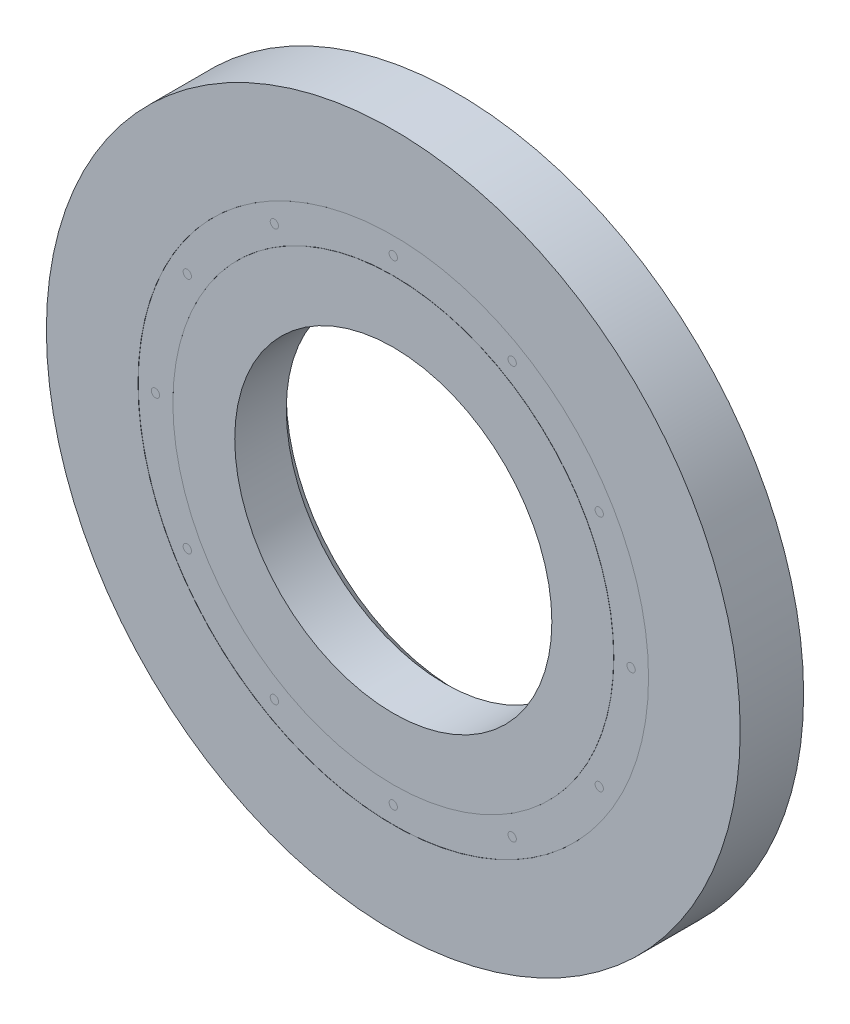
ISO-10303-21;
HEADER;
FILE_DESCRIPTION(('STEP AP214'),'2;1');
FILE_NAME('part.step','',(''),(''),'','','');
FILE_SCHEMA(('AUTOMOTIVE_DESIGN { 1 0 10303 214 1 1 1 1 }'));
ENDSEC;
DATA;
#1=APPLICATION_CONTEXT('core data for automotive mechanical design processes');
#2=APPLICATION_PROTOCOL_DEFINITION('international standard','automotive_design',2000,#1);
#3=PRODUCT_CONTEXT('',#1,'mechanical');
#4=PRODUCT('Part','Part','',(#3));
#5=PRODUCT_RELATED_PRODUCT_CATEGORY('part','',(#4));
#6=PRODUCT_DEFINITION_FORMATION('','',#4);
#7=PRODUCT_DEFINITION_CONTEXT('part definition',#1,'design');
#8=PRODUCT_DEFINITION('design','',#6,#7);
#9=PRODUCT_DEFINITION_SHAPE('','',#8);
#10=(LENGTH_UNIT() NAMED_UNIT(*) SI_UNIT(.MILLI.,.METRE.));
#11=(NAMED_UNIT(*) PLANE_ANGLE_UNIT() SI_UNIT($,.RADIAN.));
#12=(NAMED_UNIT(*) SI_UNIT($,.STERADIAN.) SOLID_ANGLE_UNIT());
#13=UNCERTAINTY_MEASURE_WITH_UNIT(LENGTH_MEASURE(1.E-05),#10,'distance_accuracy_value','');
#14=(GEOMETRIC_REPRESENTATION_CONTEXT(3) GLOBAL_UNCERTAINTY_ASSIGNED_CONTEXT((#13)) GLOBAL_UNIT_ASSIGNED_CONTEXT((#10,
#11,#12)) REPRESENTATION_CONTEXT('',''));
#15=CARTESIAN_POINT('',(0.,0.,0.));
#16=DIRECTION('',(0.,0.,1.));
#17=DIRECTION('',(1.,0.,0.));
#18=AXIS2_PLACEMENT_3D('',#15,#16,#17);
#19=CARTESIAN_POINT('',(0.,5.1114010989011,-2.2621875));
#20=DIRECTION('',(0.,0.,1.));
#21=DIRECTION('',(1.,0.,0.));
#22=AXIS2_PLACEMENT_3D('',#19,#20,#21);
#23=PLANE('',#22);
#24=CARTESIAN_POINT('',(0.,0.,-2.2621875));
#25=DIRECTION('',(0.,0.,1.));
#26=DIRECTION('',(1.,0.,0.));
#27=AXIS2_PLACEMENT_3D('',#24,#25,#26);
#28=CIRCLE('',#27,5.1114010989011);
#29=CARTESIAN_POINT('',(5.1114010989011,0.,-2.2621875));
#30=VERTEX_POINT('',#29);
#31=EDGE_CURVE('E57',#30,#30,#28,.T.);
#32=ORIENTED_EDGE('',*,*,#31,.F.);
#33=EDGE_LOOP('',(#32));
#34=FACE_BOUND('',#33,.T.);
#35=CARTESIAN_POINT('',(0.,0.,-2.2621875));
#36=DIRECTION('',(0.,0.,1.));
#37=DIRECTION('',(1.,0.,0.));
#38=AXIS2_PLACEMENT_3D('',#35,#36,#37);
#39=CIRCLE('',#38,4.4135989010989);
#40=CARTESIAN_POINT('',(4.4135989010989,0.,-2.2621875));
#41=VERTEX_POINT('',#40);
#42=EDGE_CURVE('E11',#41,#41,#39,.T.);
#43=ORIENTED_EDGE('',*,*,#42,.T.);
#44=EDGE_LOOP('',(#43));
#45=FACE_BOUND('',#44,.T.);
#46=ADVANCED_FACE('F43',(#34,#45),#23,.F.);
#47=CARTESIAN_POINT('',(0.,0.,2.38125));
#48=DIRECTION('',(0.,0.,1.));
#49=DIRECTION('',(1.,0.,0.));
#50=AXIS2_PLACEMENT_3D('',#47,#48,#49);
#51=CYLINDRICAL_SURFACE('',#50,4.4135989010989);
#52=ORIENTED_EDGE('',*,*,#42,.F.);
#53=EDGE_LOOP('',(#52));
#54=FACE_BOUND('',#53,.T.);
#55=CARTESIAN_POINT('',(0.,0.,-1.11436144103197));
#56=DIRECTION('',(0.,0.,1.));
#57=DIRECTION('',(1.,0.,0.));
#58=AXIS2_PLACEMENT_3D('',#55,#56,#57);
#59=CIRCLE('',#58,4.4135989010989);
#60=CARTESIAN_POINT('',(4.4135989010989,0.,-1.11436144103197));
#61=VERTEX_POINT('',#60);
#62=EDGE_CURVE('E49',#61,#61,#59,.T.);
#63=ORIENTED_EDGE('',*,*,#62,.T.);
#64=EDGE_LOOP('',(#63));
#65=FACE_BOUND('',#64,.T.);
#66=ADVANCED_FACE('F66',(#54,#65),#51,.F.);
#67=CARTESIAN_POINT('',(0.,5.1114010989011,-1.11436144103197));
#68=DIRECTION('',(0.,0.,-1.));
#69=DIRECTION('',(-1.,0.,0.));
#70=AXIS2_PLACEMENT_3D('',#67,#68,#69);
#71=PLANE('',#70);
#72=ORIENTED_EDGE('',*,*,#62,.F.);
#73=EDGE_LOOP('',(#72));
#74=FACE_BOUND('',#73,.T.);
#75=CARTESIAN_POINT('',(0.,0.,-1.11436144103197));
#76=DIRECTION('',(0.,0.,1.));
#77=DIRECTION('',(1.,0.,0.));
#78=AXIS2_PLACEMENT_3D('',#75,#76,#77);
#79=CIRCLE('',#78,5.1114010989011);
#80=CARTESIAN_POINT('',(5.1114010989011,0.,-1.11436144103197));
#81=VERTEX_POINT('',#80);
#82=EDGE_CURVE('E53',#81,#81,#79,.T.);
#83=ORIENTED_EDGE('',*,*,#82,.T.);
#84=EDGE_LOOP('',(#83));
#85=FACE_BOUND('',#84,.T.);
#86=ADVANCED_FACE('F70',(#74,#85),#71,.F.);
#87=CARTESIAN_POINT('',(0.,0.,2.38125));
#88=DIRECTION('',(0.,0.,1.));
#89=DIRECTION('',(1.,0.,0.));
#90=AXIS2_PLACEMENT_3D('',#87,#88,#89);
#91=CYLINDRICAL_SURFACE('',#90,5.1114010989011);
#92=ORIENTED_EDGE('',*,*,#82,.F.);
#93=EDGE_LOOP('',(#92));
#94=FACE_BOUND('',#93,.T.);
#95=ORIENTED_EDGE('',*,*,#31,.T.);
#96=EDGE_LOOP('',(#95));
#97=FACE_BOUND('',#96,.T.);
#98=ADVANCED_FACE('F63',(#94,#97),#91,.T.);
#99=CLOSED_SHELL('',(#46,#66,#86,#98));
#100=MANIFOLD_SOLID_BREP('B2',#99);
#101=CARTESIAN_POINT('',(-2.38124999999995,4.12444598552342,0.));
#102=DIRECTION('',(0.,0.,1.));
#103=DIRECTION('',(-0.499999999999989,0.866025403784445,0.));
#104=AXIS2_PLACEMENT_3D('',#101,#102,#103);
#105=SPHERICAL_SURFACE('',#104,1.11436144103197);
#106=CARTESIAN_POINT('',(-2.38124999999995,4.12444598552342,-1.11124999999997));
#107=DIRECTION('',(0.,0.,-1.));
#108=DIRECTION('',(-1.,0.,0.));
#109=AXIS2_PLACEMENT_3D('',#106,#107,#108);
#110=CIRCLE('',#109,0.0832157362456983);
#111=CARTESIAN_POINT('',(-2.46446573624565,4.12444598552342,-1.11124999999997));
#112=VERTEX_POINT('',#111);
#113=EDGE_CURVE('E42',#112,#112,#110,.T.);
#114=ORIENTED_EDGE('',*,*,#113,.T.);
#115=EDGE_LOOP('',(#114));
#116=FACE_BOUND('',#115,.T.);
#117=ADVANCED_FACE('F112',(#116),#105,.T.);
#118=CARTESIAN_POINT('',(0.,0.,-1.11124999999997));
#119=DIRECTION('',(0.,0.,-1.));
#120=DIRECTION('',(-1.,0.,0.));
#121=AXIS2_PLACEMENT_3D('',#118,#119,#120);
#122=PLANE('',#121);
#123=ORIENTED_EDGE('',*,*,#113,.F.);
#124=EDGE_LOOP('',(#123));
#125=FACE_BOUND('',#124,.T.);
#126=ADVANCED_FACE('F120',(#125),#122,.F.);
#127=CLOSED_SHELL('',(#117,#126));
#128=MANIFOLD_SOLID_BREP('B6',#127);
#129=CARTESIAN_POINT('',(-4.12444598552336,2.38125000000005,0.));
#130=DIRECTION('',(0.,0.,1.));
#131=DIRECTION('',(-0.866025403784433,0.50000000000001,0.));
#132=AXIS2_PLACEMENT_3D('',#129,#130,#131);
#133=SPHERICAL_SURFACE('',#132,1.11436144103197);
#134=CARTESIAN_POINT('',(-4.12444598552336,2.38125000000005,-1.11124999999997));
#135=DIRECTION('',(0.,0.,-1.));
#136=DIRECTION('',(-1.,0.,0.));
#137=AXIS2_PLACEMENT_3D('',#134,#135,#136);
#138=CIRCLE('',#137,0.0832157362457047);
#139=CARTESIAN_POINT('',(-4.20766172176906,2.38125000000005,-1.11124999999997));
#140=VERTEX_POINT('',#139);
#141=EDGE_CURVE('E111',#140,#140,#138,.T.);
#142=ORIENTED_EDGE('',*,*,#141,.T.);
#143=EDGE_LOOP('',(#142));
#144=FACE_BOUND('',#143,.T.);
#145=ADVANCED_FACE('F147',(#144),#133,.T.);
#146=CARTESIAN_POINT('',(0.,0.,-1.11124999999997));
#147=DIRECTION('',(0.,0.,-1.));
#148=DIRECTION('',(-1.,0.,0.));
#149=AXIS2_PLACEMENT_3D('',#146,#147,#148);
#150=PLANE('',#149);
#151=ORIENTED_EDGE('',*,*,#141,.F.);
#152=EDGE_LOOP('',(#151));
#153=FACE_BOUND('',#152,.T.);
#154=ADVANCED_FACE('F155',(#153),#150,.F.);
#155=CLOSED_SHELL('',(#145,#154));
#156=MANIFOLD_SOLID_BREP('B37',#155);
#157=CARTESIAN_POINT('',(-4.7625,0.,0.));
#158=DIRECTION('',(0.,0.,1.));
#159=DIRECTION('',(-1.,0.,0.));
#160=AXIS2_PLACEMENT_3D('',#157,#158,#159);
#161=SPHERICAL_SURFACE('',#160,1.11436144103197);
#162=CARTESIAN_POINT('',(-4.7625,0.,-1.11124999999997));
#163=DIRECTION('',(0.,0.,-1.));
#164=DIRECTION('',(-1.,0.,0.));
#165=AXIS2_PLACEMENT_3D('',#162,#163,#164);
#166=CIRCLE('',#165,0.0832157362457047);
#167=CARTESIAN_POINT('',(-4.8457157362457,0.,-1.11124999999997));
#168=VERTEX_POINT('',#167);
#169=EDGE_CURVE('E146',#168,#168,#166,.T.);
#170=ORIENTED_EDGE('',*,*,#169,.T.);
#171=EDGE_LOOP('',(#170));
#172=FACE_BOUND('',#171,.T.);
#173=ADVANCED_FACE('F182',(#172),#161,.T.);
#174=CARTESIAN_POINT('',(0.,0.,-1.11124999999997));
#175=DIRECTION('',(0.,0.,-1.));
#176=DIRECTION('',(-1.,0.,0.));
#177=AXIS2_PLACEMENT_3D('',#174,#175,#176);
#178=PLANE('',#177);
#179=ORIENTED_EDGE('',*,*,#169,.F.);
#180=EDGE_LOOP('',(#179));
#181=FACE_BOUND('',#180,.T.);
#182=ADVANCED_FACE('F190',(#181),#178,.F.);
#183=CLOSED_SHELL('',(#173,#182));
#184=MANIFOLD_SOLID_BREP('B106',#183);
#185=CARTESIAN_POINT('',(-4.12444598552341,-2.38124999999996,0.));
#186=DIRECTION('',(0.,0.,1.));
#187=DIRECTION('',(-0.866025403784443,-0.499999999999992,0.));
#188=AXIS2_PLACEMENT_3D('',#185,#186,#187);
#189=SPHERICAL_SURFACE('',#188,1.11436144103197);
#190=CARTESIAN_POINT('',(-4.12444598552341,-2.38124999999996,-1.11124999999997));
#191=DIRECTION('',(0.,0.,-1.));
#192=DIRECTION('',(-1.,0.,0.));
#193=AXIS2_PLACEMENT_3D('',#190,#191,#192);
#194=CIRCLE('',#193,0.0832157362457021);
#195=CARTESIAN_POINT('',(-4.20766172176911,-2.38124999999996,-1.11124999999997));
#196=VERTEX_POINT('',#195);
#197=EDGE_CURVE('E181',#196,#196,#194,.T.);
#198=ORIENTED_EDGE('',*,*,#197,.T.);
#199=EDGE_LOOP('',(#198));
#200=FACE_BOUND('',#199,.T.);
#201=ADVANCED_FACE('F217',(#200),#189,.T.);
#202=CARTESIAN_POINT('',(0.,0.,-1.11124999999997));
#203=DIRECTION('',(0.,0.,-1.));
#204=DIRECTION('',(-1.,0.,0.));
#205=AXIS2_PLACEMENT_3D('',#202,#203,#204);
#206=PLANE('',#205);
#207=ORIENTED_EDGE('',*,*,#197,.F.);
#208=EDGE_LOOP('',(#207));
#209=FACE_BOUND('',#208,.T.);
#210=ADVANCED_FACE('F225',(#209),#206,.F.);
#211=CLOSED_SHELL('',(#201,#210));
#212=MANIFOLD_SOLID_BREP('B141',#211);
#213=CARTESIAN_POINT('',(-2.38125000000003,-4.12444598552337,0.));
#214=DIRECTION('',(0.,0.,1.));
#215=DIRECTION('',(-0.500000000000007,-0.866025403784435,0.));
#216=AXIS2_PLACEMENT_3D('',#213,#214,#215);
#217=SPHERICAL_SURFACE('',#216,1.11436144103197);
#218=CARTESIAN_POINT('',(-2.38125000000003,-4.12444598552337,-1.11124999999997));
#219=DIRECTION('',(0.,0.,-1.));
#220=DIRECTION('',(-1.,0.,0.));
#221=AXIS2_PLACEMENT_3D('',#218,#219,#220);
#222=CIRCLE('',#221,0.0832157362456983);
#223=CARTESIAN_POINT('',(-2.46446573624573,-4.12444598552337,-1.11124999999997));
#224=VERTEX_POINT('',#223);
#225=EDGE_CURVE('E216',#224,#224,#222,.T.);
#226=ORIENTED_EDGE('',*,*,#225,.T.);
#227=EDGE_LOOP('',(#226));
#228=FACE_BOUND('',#227,.T.);
#229=ADVANCED_FACE('F252',(#228),#217,.T.);
#230=CARTESIAN_POINT('',(0.,0.,-1.11124999999997));
#231=DIRECTION('',(0.,0.,-1.));
#232=DIRECTION('',(-1.,0.,0.));
#233=AXIS2_PLACEMENT_3D('',#230,#231,#232);
#234=PLANE('',#233);
#235=ORIENTED_EDGE('',*,*,#225,.F.);
#236=EDGE_LOOP('',(#235));
#237=FACE_BOUND('',#236,.T.);
#238=ADVANCED_FACE('F260',(#237),#234,.F.);
#239=CLOSED_SHELL('',(#229,#238));
#240=MANIFOLD_SOLID_BREP('B176',#239);
#241=CARTESIAN_POINT('',(0.,-4.7625,0.));
#242=DIRECTION('',(0.,0.,1.));
#243=DIRECTION('',(0.,-1.,0.));
#244=AXIS2_PLACEMENT_3D('',#241,#242,#243);
#245=SPHERICAL_SURFACE('',#244,1.11436144103197);
#246=CARTESIAN_POINT('',(0.,-4.7625,-1.11124999999997));
#247=DIRECTION('',(0.,0.,-1.));
#248=DIRECTION('',(-1.,0.,0.));
#249=AXIS2_PLACEMENT_3D('',#246,#247,#248);
#250=CIRCLE('',#249,0.0832157362456907);
#251=CARTESIAN_POINT('',(-0.0832157362457242,-4.7625,-1.11124999999997));
#252=VERTEX_POINT('',#251);
#253=EDGE_CURVE('E251',#252,#252,#250,.T.);
#254=ORIENTED_EDGE('',*,*,#253,.T.);
#255=EDGE_LOOP('',(#254));
#256=FACE_BOUND('',#255,.T.);
#257=ADVANCED_FACE('F287',(#256),#245,.T.);
#258=CARTESIAN_POINT('',(0.,0.,-1.11124999999997));
#259=DIRECTION('',(0.,0.,-1.));
#260=DIRECTION('',(-1.,0.,0.));
#261=AXIS2_PLACEMENT_3D('',#258,#259,#260);
#262=PLANE('',#261);
#263=ORIENTED_EDGE('',*,*,#253,.F.);
#264=EDGE_LOOP('',(#263));
#265=FACE_BOUND('',#264,.T.);
#266=ADVANCED_FACE('F295',(#265),#262,.F.);
#267=CLOSED_SHELL('',(#257,#266));
#268=MANIFOLD_SOLID_BREP('B211',#267);
#269=CARTESIAN_POINT('',(2.38124999999998,-4.1244459855234,0.));
#270=DIRECTION('',(0.,0.,1.));
#271=DIRECTION('',(0.499999999999995,-0.866025403784442,0.));
#272=AXIS2_PLACEMENT_3D('',#269,#270,#271);
#273=SPHERICAL_SURFACE('',#272,1.11436144103197);
#274=CARTESIAN_POINT('',(2.38124999999998,-4.1244459855234,-1.11124999999997));
#275=DIRECTION('',(0.,0.,-1.));
#276=DIRECTION('',(-1.,0.,0.));
#277=AXIS2_PLACEMENT_3D('',#274,#275,#276);
#278=CIRCLE('',#277,0.0832157362456818);
#279=CARTESIAN_POINT('',(2.29803426375429,-4.1244459855234,-1.11124999999997));
#280=VERTEX_POINT('',#279);
#281=EDGE_CURVE('E286',#280,#280,#278,.T.);
#282=ORIENTED_EDGE('',*,*,#281,.T.);
#283=EDGE_LOOP('',(#282));
#284=FACE_BOUND('',#283,.T.);
#285=ADVANCED_FACE('F322',(#284),#273,.T.);
#286=CARTESIAN_POINT('',(0.,0.,-1.11124999999997));
#287=DIRECTION('',(0.,0.,-1.));
#288=DIRECTION('',(-1.,0.,0.));
#289=AXIS2_PLACEMENT_3D('',#286,#287,#288);
#290=PLANE('',#289);
#291=ORIENTED_EDGE('',*,*,#281,.F.);
#292=EDGE_LOOP('',(#291));
#293=FACE_BOUND('',#292,.T.);
#294=ADVANCED_FACE('F330',(#293),#290,.F.);
#295=CLOSED_SHELL('',(#285,#294));
#296=MANIFOLD_SOLID_BREP('B246',#295);
#297=CARTESIAN_POINT('',(4.12444598552338,-2.38125000000002,0.));
#298=DIRECTION('',(0.,0.,1.));
#299=DIRECTION('',(0.866025403784436,-0.500000000000004,0.));
#300=AXIS2_PLACEMENT_3D('',#297,#298,#299);
#301=SPHERICAL_SURFACE('',#300,1.11436144103197);
#302=CARTESIAN_POINT('',(4.12444598552338,-2.38125000000002,-1.11124999999997));
#303=DIRECTION('',(0.,0.,-1.));
#304=DIRECTION('',(-1.,0.,0.));
#305=AXIS2_PLACEMENT_3D('',#302,#303,#304);
#306=CIRCLE('',#305,0.0832157362456754);
#307=CARTESIAN_POINT('',(4.0412302492777,-2.38125000000002,-1.11124999999997));
#308=VERTEX_POINT('',#307);
#309=EDGE_CURVE('E321',#308,#308,#306,.T.);
#310=ORIENTED_EDGE('',*,*,#309,.T.);
#311=EDGE_LOOP('',(#310));
#312=FACE_BOUND('',#311,.T.);
#313=ADVANCED_FACE('F357',(#312),#301,.T.);
#314=CARTESIAN_POINT('',(0.,0.,-1.11124999999997));
#315=DIRECTION('',(0.,0.,-1.));
#316=DIRECTION('',(-1.,0.,0.));
#317=AXIS2_PLACEMENT_3D('',#314,#315,#316);
#318=PLANE('',#317);
#319=ORIENTED_EDGE('',*,*,#309,.F.);
#320=EDGE_LOOP('',(#319));
#321=FACE_BOUND('',#320,.T.);
#322=ADVANCED_FACE('F365',(#321),#318,.F.);
#323=CLOSED_SHELL('',(#313,#322));
#324=MANIFOLD_SOLID_BREP('B281',#323);
#325=CARTESIAN_POINT('',(4.7625,0.,0.));
#326=DIRECTION('',(0.,0.,1.));
#327=DIRECTION('',(1.,0.,0.));
#328=AXIS2_PLACEMENT_3D('',#325,#326,#327);
#329=SPHERICAL_SURFACE('',#328,1.11436144103197);
#330=CARTESIAN_POINT('',(4.7625,0.,-1.11124999999997));
#331=DIRECTION('',(0.,0.,-1.));
#332=DIRECTION('',(-1.,0.,0.));
#333=AXIS2_PLACEMENT_3D('',#330,#331,#332);
#334=CIRCLE('',#333,0.0832157362456754);
#335=CARTESIAN_POINT('',(4.67928426375432,0.,-1.11124999999997));
#336=VERTEX_POINT('',#335);
#337=EDGE_CURVE('E356',#336,#336,#334,.T.);
#338=ORIENTED_EDGE('',*,*,#337,.T.);
#339=EDGE_LOOP('',(#338));
#340=FACE_BOUND('',#339,.T.);
#341=ADVANCED_FACE('F392',(#340),#329,.T.);
#342=CARTESIAN_POINT('',(0.,0.,-1.11124999999997));
#343=DIRECTION('',(0.,0.,-1.));
#344=DIRECTION('',(-1.,0.,0.));
#345=AXIS2_PLACEMENT_3D('',#342,#343,#344);
#346=PLANE('',#345);
#347=ORIENTED_EDGE('',*,*,#337,.F.);
#348=EDGE_LOOP('',(#347));
#349=FACE_BOUND('',#348,.T.);
#350=ADVANCED_FACE('F400',(#349),#346,.F.);
#351=CLOSED_SHELL('',(#341,#350));
#352=MANIFOLD_SOLID_BREP('B316',#351);
#353=CARTESIAN_POINT('',(4.12444598552339,2.38124999999999,0.));
#354=DIRECTION('',(0.,0.,1.));
#355=DIRECTION('',(0.86602540378444,0.499999999999998,0.));
#356=AXIS2_PLACEMENT_3D('',#353,#354,#355);
#357=SPHERICAL_SURFACE('',#356,1.11436144103197);
#358=CARTESIAN_POINT('',(4.12444598552339,2.38124999999999,-1.11124999999997));
#359=DIRECTION('',(0.,0.,-1.));
#360=DIRECTION('',(-1.,0.,0.));
#361=AXIS2_PLACEMENT_3D('',#358,#359,#360);
#362=CIRCLE('',#361,0.0832157362456779);
#363=CARTESIAN_POINT('',(4.04123024927772,2.38124999999999,-1.11124999999997));
#364=VERTEX_POINT('',#363);
#365=EDGE_CURVE('E391',#364,#364,#362,.T.);
#366=ORIENTED_EDGE('',*,*,#365,.T.);
#367=EDGE_LOOP('',(#366));
#368=FACE_BOUND('',#367,.T.);
#369=ADVANCED_FACE('F427',(#368),#357,.T.);
#370=CARTESIAN_POINT('',(0.,0.,-1.11124999999997));
#371=DIRECTION('',(0.,0.,-1.));
#372=DIRECTION('',(-1.,0.,0.));
#373=AXIS2_PLACEMENT_3D('',#370,#371,#372);
#374=PLANE('',#373);
#375=ORIENTED_EDGE('',*,*,#365,.F.);
#376=EDGE_LOOP('',(#375));
#377=FACE_BOUND('',#376,.T.);
#378=ADVANCED_FACE('F435',(#377),#374,.F.);
#379=CLOSED_SHELL('',(#369,#378));
#380=MANIFOLD_SOLID_BREP('B351',#379);
#381=CARTESIAN_POINT('',(2.38125,4.12444598552339,0.));
#382=DIRECTION('',(0.,0.,1.));
#383=DIRECTION('',(0.500000000000001,0.866025403784438,0.));
#384=AXIS2_PLACEMENT_3D('',#381,#382,#383);
#385=SPHERICAL_SURFACE('',#384,1.11436144103197);
#386=CARTESIAN_POINT('',(2.38125,4.12444598552339,-1.11124999999997));
#387=DIRECTION('',(0.,0.,-1.));
#388=DIRECTION('',(-1.,0.,0.));
#389=AXIS2_PLACEMENT_3D('',#386,#387,#388);
#390=CIRCLE('',#389,0.0832157362456818);
#391=CARTESIAN_POINT('',(2.29803426375432,4.12444598552339,-1.11124999999997));
#392=VERTEX_POINT('',#391);
#393=EDGE_CURVE('E426',#392,#392,#390,.T.);
#394=ORIENTED_EDGE('',*,*,#393,.T.);
#395=EDGE_LOOP('',(#394));
#396=FACE_BOUND('',#395,.T.);
#397=ADVANCED_FACE('F462',(#396),#385,.T.);
#398=CARTESIAN_POINT('',(0.,0.,-1.11124999999997));
#399=DIRECTION('',(0.,0.,-1.));
#400=DIRECTION('',(-1.,0.,0.));
#401=AXIS2_PLACEMENT_3D('',#398,#399,#400);
#402=PLANE('',#401);
#403=ORIENTED_EDGE('',*,*,#393,.F.);
#404=EDGE_LOOP('',(#403));
#405=FACE_BOUND('',#404,.T.);
#406=ADVANCED_FACE('F470',(#405),#402,.F.);
#407=CLOSED_SHELL('',(#397,#406));
#408=MANIFOLD_SOLID_BREP('B386',#407);
#409=CARTESIAN_POINT('',(0.,4.7625,0.));
#410=DIRECTION('',(0.,0.,1.));
#411=DIRECTION('',(0.,1.,0.));
#412=AXIS2_PLACEMENT_3D('',#409,#410,#411);
#413=SPHERICAL_SURFACE('',#412,1.11436144103197);
#414=CARTESIAN_POINT('',(0.,4.7625,-1.11124999999997));
#415=DIRECTION('',(0.,0.,-1.));
#416=DIRECTION('',(-1.,0.,0.));
#417=AXIS2_PLACEMENT_3D('',#414,#415,#416);
#418=CIRCLE('',#417,0.0832157362456907);
#419=CARTESIAN_POINT('',(-0.0832157362456909,4.7625,-1.11124999999997));
#420=VERTEX_POINT('',#419);
#421=EDGE_CURVE('E461',#420,#420,#418,.T.);
#422=ORIENTED_EDGE('',*,*,#421,.T.);
#423=EDGE_LOOP('',(#422));
#424=FACE_BOUND('',#423,.T.);
#425=ADVANCED_FACE('F497',(#424),#413,.T.);
#426=CARTESIAN_POINT('',(0.,0.,-1.11124999999997));
#427=DIRECTION('',(0.,0.,-1.));
#428=DIRECTION('',(-1.,0.,0.));
#429=AXIS2_PLACEMENT_3D('',#426,#427,#428);
#430=PLANE('',#429);
#431=ORIENTED_EDGE('',*,*,#421,.F.);
#432=EDGE_LOOP('',(#431));
#433=FACE_BOUND('',#432,.T.);
#434=ADVANCED_FACE('F505',(#433),#430,.F.);
#435=CLOSED_SHELL('',(#425,#434));
#436=MANIFOLD_SOLID_BREP('B421',#435);
#437=CARTESIAN_POINT('',(0.,0.,2.38125));
#438=DIRECTION('',(0.,0.,1.));
#439=DIRECTION('',(1.,0.,0.));
#440=AXIS2_PLACEMENT_3D('',#437,#438,#439);
#441=CYLINDRICAL_SURFACE('',#440,4.4135989010989);
#442=CARTESIAN_POINT('',(0.,0.,-1.11124999999997));
#443=DIRECTION('',(0.,0.,-1.));
#444=DIRECTION('',(-1.,0.,0.));
#445=AXIS2_PLACEMENT_3D('',#442,#443,#444);
#446=CIRCLE('',#445,4.4135989010989);
#447=CARTESIAN_POINT('',(-4.4135989010989,0.,-1.11124999999997));
#448=VERTEX_POINT('',#447);
#449=EDGE_CURVE('E545',#448,#448,#446,.T.);
#450=ORIENTED_EDGE('',*,*,#449,.T.);
#451=EDGE_LOOP('',(#450));
#452=FACE_BOUND('',#451,.T.);
#453=CARTESIAN_POINT('',(0.,0.,-2.38125));
#454=DIRECTION('',(0.,0.,1.));
#455=DIRECTION('',(1.,0.,0.));
#456=AXIS2_PLACEMENT_3D('',#453,#454,#455);
#457=CIRCLE('',#456,4.4135989010989);
#458=CARTESIAN_POINT('',(4.4135989010989,0.,-2.38125));
#459=VERTEX_POINT('',#458);
#460=EDGE_CURVE('E496',#459,#459,#457,.T.);
#461=ORIENTED_EDGE('',*,*,#460,.T.);
#462=EDGE_LOOP('',(#461));
#463=FACE_BOUND('',#462,.T.);
#464=ADVANCED_FACE('F529',(#452,#463),#441,.T.);
#465=CARTESIAN_POINT('',(0.,3.413125,-2.38125));
#466=DIRECTION('',(0.,0.,1.));
#467=DIRECTION('',(1.,0.,0.));
#468=AXIS2_PLACEMENT_3D('',#465,#466,#467);
#469=PLANE('',#468);
#470=ORIENTED_EDGE('',*,*,#460,.F.);
#471=EDGE_LOOP('',(#470));
#472=FACE_BOUND('',#471,.T.);
#473=CARTESIAN_POINT('',(0.,0.,-2.38125));
#474=DIRECTION('',(0.,0.,1.));
#475=DIRECTION('',(1.,0.,0.));
#476=AXIS2_PLACEMENT_3D('',#473,#474,#475);
#477=CIRCLE('',#476,3.413125);
#478=CARTESIAN_POINT('',(3.413125,0.,-2.38125));
#479=VERTEX_POINT('',#478);
#480=EDGE_CURVE('E536',#479,#479,#477,.T.);
#481=ORIENTED_EDGE('',*,*,#480,.T.);
#482=EDGE_LOOP('',(#481));
#483=FACE_BOUND('',#482,.T.);
#484=ADVANCED_FACE('F566',(#472,#483),#469,.F.);
#485=CARTESIAN_POINT('',(0.,0.,-2.143125));
#486=DIRECTION('',(0.,0.,-1.));
#487=DIRECTION('',(-1.,0.,0.));
#488=AXIS2_PLACEMENT_3D('',#485,#486,#487);
#489=CONICAL_SURFACE('',#488,3.175,0.785398163397443);
#490=ORIENTED_EDGE('',*,*,#480,.F.);
#491=EDGE_LOOP('',(#490));
#492=FACE_BOUND('',#491,.T.);
#493=CARTESIAN_POINT('',(0.,0.,-2.143125));
#494=DIRECTION('',(0.,0.,1.));
#495=DIRECTION('',(1.,0.,0.));
#496=AXIS2_PLACEMENT_3D('',#493,#494,#495);
#497=CIRCLE('',#496,3.175);
#498=CARTESIAN_POINT('',(3.175,0.,-2.143125));
#499=VERTEX_POINT('',#498);
#500=EDGE_CURVE('E540',#499,#499,#497,.T.);
#501=ORIENTED_EDGE('',*,*,#500,.T.);
#502=EDGE_LOOP('',(#501));
#503=FACE_BOUND('',#502,.T.);
#504=ADVANCED_FACE('F563',(#492,#503),#489,.F.);
#505=CARTESIAN_POINT('',(0.,0.,2.38125));
#506=DIRECTION('',(0.,0.,1.));
#507=DIRECTION('',(1.,0.,0.));
#508=AXIS2_PLACEMENT_3D('',#505,#506,#507);
#509=CYLINDRICAL_SURFACE('',#508,3.175);
#510=CARTESIAN_POINT('',(0.,0.,-1.11124999999997));
#511=DIRECTION('',(0.,0.,-1.));
#512=DIRECTION('',(-1.,0.,0.));
#513=AXIS2_PLACEMENT_3D('',#510,#511,#512);
#514=CIRCLE('',#513,3.175);
#515=CARTESIAN_POINT('',(-3.175,0.,-1.11124999999997));
#516=VERTEX_POINT('',#515);
#517=EDGE_CURVE('E532',#516,#516,#514,.F.);
#518=ORIENTED_EDGE('',*,*,#517,.T.);
#519=EDGE_LOOP('',(#518));
#520=FACE_BOUND('',#519,.T.);
#521=ORIENTED_EDGE('',*,*,#500,.F.);
#522=EDGE_LOOP('',(#521));
#523=FACE_BOUND('',#522,.T.);
#524=ADVANCED_FACE('F552',(#520,#523),#509,.F.);
#525=CARTESIAN_POINT('',(0.,0.,-1.11124999999997));
#526=DIRECTION('',(0.,0.,-1.));
#527=DIRECTION('',(-1.,0.,0.));
#528=AXIS2_PLACEMENT_3D('',#525,#526,#527);
#529=PLANE('',#528);
#530=ORIENTED_EDGE('',*,*,#517,.F.);
#531=EDGE_LOOP('',(#530));
#532=FACE_BOUND('',#531,.T.);
#533=ORIENTED_EDGE('',*,*,#449,.F.);
#534=EDGE_LOOP('',(#533));
#535=FACE_BOUND('',#534,.T.);
#536=ADVANCED_FACE('F555',(#532,#535),#529,.F.);
#537=CLOSED_SHELL('',(#464,#484,#504,#524,#536));
#538=MANIFOLD_SOLID_BREP('B456',#537);
#539=CARTESIAN_POINT('',(0.,6.111875,-2.38125));
#540=DIRECTION('',(0.,0.,1.));
#541=DIRECTION('',(1.,0.,0.));
#542=AXIS2_PLACEMENT_3D('',#539,#540,#541);
#543=PLANE('',#542);
#544=CARTESIAN_POINT('',(0.,0.,-2.38125));
#545=DIRECTION('',(0.,0.,1.));
#546=DIRECTION('',(1.,0.,0.));
#547=AXIS2_PLACEMENT_3D('',#544,#545,#546);
#548=CIRCLE('',#547,5.1114010989011);
#549=CARTESIAN_POINT('',(5.1114010989011,0.,-2.38125));
#550=VERTEX_POINT('',#549);
#551=EDGE_CURVE('E528',#550,#550,#548,.T.);
#552=ORIENTED_EDGE('',*,*,#551,.T.);
#553=EDGE_LOOP('',(#552));
#554=FACE_BOUND('',#553,.T.);
#555=CARTESIAN_POINT('',(0.,0.,-2.38125));
#556=DIRECTION('',(0.,0.,-1.));
#557=DIRECTION('',(-1.,0.,0.));
#558=AXIS2_PLACEMENT_3D('',#555,#556,#557);
#559=CIRCLE('',#558,6.9469);
#560=CARTESIAN_POINT('',(-6.9469,0.,-2.38125));
#561=VERTEX_POINT('',#560);
#562=EDGE_CURVE('E612',#561,#561,#559,.T.);
#563=ORIENTED_EDGE('',*,*,#562,.T.);
#564=EDGE_LOOP('',(#563));
#565=FACE_BOUND('',#564,.T.);
#566=ADVANCED_FACE('F605',(#554,#565),#543,.F.);
#567=CARTESIAN_POINT('',(0.,0.,2.38125));
#568=DIRECTION('',(0.,0.,1.));
#569=DIRECTION('',(1.,0.,0.));
#570=AXIS2_PLACEMENT_3D('',#567,#568,#569);
#571=CYLINDRICAL_SURFACE('',#570,5.1114010989011);
#572=CARTESIAN_POINT('',(0.,0.,-1.11124999999997));
#573=DIRECTION('',(0.,0.,-1.));
#574=DIRECTION('',(-1.,0.,0.));
#575=AXIS2_PLACEMENT_3D('',#572,#573,#574);
#576=CIRCLE('',#575,5.1114010989011);
#577=CARTESIAN_POINT('',(-5.1114010989011,0.,-1.11124999999997));
#578=VERTEX_POINT('',#577);
#579=EDGE_CURVE('E608',#578,#578,#576,.F.);
#580=ORIENTED_EDGE('',*,*,#579,.T.);
#581=EDGE_LOOP('',(#580));
#582=FACE_BOUND('',#581,.T.);
#583=ORIENTED_EDGE('',*,*,#551,.F.);
#584=EDGE_LOOP('',(#583));
#585=FACE_BOUND('',#584,.T.);
#586=ADVANCED_FACE('F625',(#582,#585),#571,.F.);
#587=CARTESIAN_POINT('',(0.,5.1114010989011,-1.11125));
#588=DIRECTION('',(0.,0.,1.));
#589=DIRECTION('',(1.,0.,0.));
#590=AXIS2_PLACEMENT_3D('',#587,#588,#589);
#591=PLANE('',#590);
#592=CARTESIAN_POINT('',(0.,0.,-1.11125));
#593=DIRECTION('',(0.,0.,-1.));
#594=DIRECTION('',(-1.,0.,0.));
#595=AXIS2_PLACEMENT_3D('',#592,#593,#594);
#596=CIRCLE('',#595,6.9469);
#597=CARTESIAN_POINT('',(-6.9469,0.,-1.11125));
#598=VERTEX_POINT('',#597);
#599=EDGE_CURVE('E616',#598,#598,#596,.T.);
#600=ORIENTED_EDGE('',*,*,#599,.F.);
#601=EDGE_LOOP('',(#600));
#602=FACE_BOUND('',#601,.T.);
#603=ORIENTED_EDGE('',*,*,#579,.F.);
#604=EDGE_LOOP('',(#603));
#605=FACE_BOUND('',#604,.T.);
#606=ADVANCED_FACE('F628',(#602,#605),#591,.T.);
#607=CARTESIAN_POINT('',(0.,0.,-2.38125));
#608=DIRECTION('',(0.,0.,-1.));
#609=DIRECTION('',(-1.,0.,0.));
#610=AXIS2_PLACEMENT_3D('',#607,#608,#609);
#611=CYLINDRICAL_SURFACE('',#610,6.9469);
#612=ORIENTED_EDGE('',*,*,#599,.T.);
#613=EDGE_LOOP('',(#612));
#614=FACE_BOUND('',#613,.T.);
#615=ORIENTED_EDGE('',*,*,#562,.F.);
#616=EDGE_LOOP('',(#615));
#617=FACE_BOUND('',#616,.T.);
#618=ADVANCED_FACE('F630',(#614,#617),#611,.T.);
#619=CLOSED_SHELL('',(#566,#586,#606,#618));
#620=MANIFOLD_SOLID_BREP('B491',#619);
#621=ADVANCED_BREP_SHAPE_REPRESENTATION('',(#18,#100,#128,#156,#184,#212,#240,#268,#296,#324,
#352,#380,#408,#436,#538,#620),#14);
#622=SHAPE_DEFINITION_REPRESENTATION(#9,#621);
ENDSEC;
END-ISO-10303-21;
